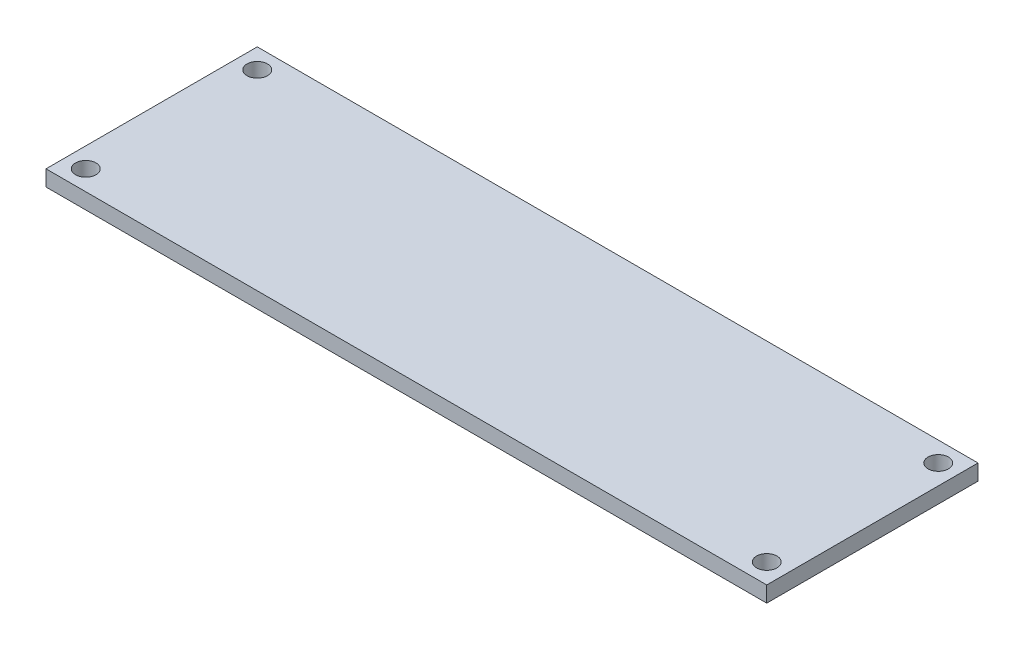
ISO-10303-21;
HEADER;
FILE_DESCRIPTION(('STEP AP214'),'2;1');
FILE_NAME('part.step','',(''),(''),'','','');
FILE_SCHEMA(('AUTOMOTIVE_DESIGN { 1 0 10303 214 1 1 1 1 }'));
ENDSEC;
DATA;
#1=APPLICATION_CONTEXT('core data for automotive mechanical design processes');
#2=APPLICATION_PROTOCOL_DEFINITION('international standard','automotive_design',2000,#1);
#3=PRODUCT_CONTEXT('',#1,'mechanical');
#4=PRODUCT('Part','Part','',(#3));
#5=PRODUCT_RELATED_PRODUCT_CATEGORY('part','',(#4));
#6=PRODUCT_DEFINITION_FORMATION('','',#4);
#7=PRODUCT_DEFINITION_CONTEXT('part definition',#1,'design');
#8=PRODUCT_DEFINITION('design','',#6,#7);
#9=PRODUCT_DEFINITION_SHAPE('','',#8);
#10=(LENGTH_UNIT() NAMED_UNIT(*) SI_UNIT(.MILLI.,.METRE.));
#11=(NAMED_UNIT(*) PLANE_ANGLE_UNIT() SI_UNIT($,.RADIAN.));
#12=(NAMED_UNIT(*) SI_UNIT($,.STERADIAN.) SOLID_ANGLE_UNIT());
#13=UNCERTAINTY_MEASURE_WITH_UNIT(LENGTH_MEASURE(1.E-05),#10,'distance_accuracy_value','');
#14=(GEOMETRIC_REPRESENTATION_CONTEXT(3) GLOBAL_UNCERTAINTY_ASSIGNED_CONTEXT((#13)) GLOBAL_UNIT_ASSIGNED_CONTEXT((#10,
#11,#12)) REPRESENTATION_CONTEXT('',''));
#15=CARTESIAN_POINT('',(0.,0.,0.));
#16=DIRECTION('',(0.,0.,1.));
#17=DIRECTION('',(1.,0.,0.));
#18=AXIS2_PLACEMENT_3D('',#15,#16,#17);
#19=CARTESIAN_POINT('',(28.9999999882,-0.635,-8.4999999926));
#20=DIRECTION('',(-1.,0.,0.));
#21=DIRECTION('',(0.,0.,1.));
#22=AXIS2_PLACEMENT_3D('',#19,#20,#21);
#23=PLANE('',#22);
#24=DIRECTION('',(0.,-1.,0.));
#25=VECTOR('',#24,1.);
#26=CARTESIAN_POINT('',(28.9999999882,0.,-8.4999999926));
#27=LINE('',#26,#25);
#28=CARTESIAN_POINT('',(28.9999999882,0.635,-8.4999999926));
#29=VERTEX_POINT('',#28);
#30=CARTESIAN_POINT('',(28.9999999882,-0.635,-8.4999999926));
#31=VERTEX_POINT('',#30);
#32=EDGE_CURVE('E73',#29,#31,#27,.T.);
#33=ORIENTED_EDGE('',*,*,#32,.F.);
#34=DIRECTION('',(0.,0.,-1.));
#35=VECTOR('',#34,1.);
#36=CARTESIAN_POINT('',(28.9999999882,0.635,0.));
#37=LINE('',#36,#35);
#38=CARTESIAN_POINT('',(28.9999999882,0.635,8.4999999926));
#39=VERTEX_POINT('',#38);
#40=EDGE_CURVE('E69',#39,#29,#37,.T.);
#41=ORIENTED_EDGE('',*,*,#40,.F.);
#42=DIRECTION('',(0.,-1.,0.));
#43=VECTOR('',#42,1.);
#44=CARTESIAN_POINT('',(28.9999999882,0.,8.4999999926));
#45=LINE('',#44,#43);
#46=CARTESIAN_POINT('',(28.9999999882,-0.635,8.4999999926));
#47=VERTEX_POINT('',#46);
#48=EDGE_CURVE('E58',#39,#47,#45,.T.);
#49=ORIENTED_EDGE('',*,*,#48,.T.);
#50=DIRECTION('',(0.,0.,-1.));
#51=VECTOR('',#50,1.);
#52=CARTESIAN_POINT('',(28.9999999882,-0.635,0.));
#53=LINE('',#52,#51);
#54=EDGE_CURVE('E97',#47,#31,#53,.T.);
#55=ORIENTED_EDGE('',*,*,#54,.T.);
#56=EDGE_LOOP('',(#33,#41,#49,#55));
#57=FACE_BOUND('',#56,.T.);
#58=ADVANCED_FACE('F16',(#57),#23,.F.);
#59=CARTESIAN_POINT('',(28.9999999882,-0.635,-8.4999999926));
#60=DIRECTION('',(0.,0.,-1.));
#61=DIRECTION('',(-1.,0.,0.));
#62=AXIS2_PLACEMENT_3D('',#59,#60,#61);
#63=PLANE('',#62);
#64=DIRECTION('',(-1.,0.,0.));
#65=VECTOR('',#64,1.);
#66=CARTESIAN_POINT('',(0.,0.635,-8.4999999926));
#67=LINE('',#66,#65);
#68=CARTESIAN_POINT('',(-28.9999999882,0.635,-8.4999999926));
#69=VERTEX_POINT('',#68);
#70=EDGE_CURVE('E75',#29,#69,#67,.T.);
#71=ORIENTED_EDGE('',*,*,#70,.F.);
#72=ORIENTED_EDGE('',*,*,#32,.T.);
#73=DIRECTION('',(-1.,0.,0.));
#74=VECTOR('',#73,1.);
#75=CARTESIAN_POINT('',(0.,-0.635,-8.4999999926));
#76=LINE('',#75,#74);
#77=CARTESIAN_POINT('',(-28.9999999882,-0.635,-8.4999999926));
#78=VERTEX_POINT('',#77);
#79=EDGE_CURVE('E107',#31,#78,#76,.T.);
#80=ORIENTED_EDGE('',*,*,#79,.T.);
#81=DIRECTION('',(0.,-1.,0.));
#82=VECTOR('',#81,1.);
#83=CARTESIAN_POINT('',(-28.9999999882,0.,-8.4999999926));
#84=LINE('',#83,#82);
#85=EDGE_CURVE('E81',#69,#78,#84,.T.);
#86=ORIENTED_EDGE('',*,*,#85,.F.);
#87=EDGE_LOOP('',(#71,#72,#80,#86));
#88=FACE_BOUND('',#87,.T.);
#89=ADVANCED_FACE('F118',(#88),#63,.T.);
#90=CARTESIAN_POINT('',(-28.9999999882,-0.635,-8.4999999926));
#91=DIRECTION('',(-1.,0.,0.));
#92=DIRECTION('',(0.,0.,1.));
#93=AXIS2_PLACEMENT_3D('',#90,#91,#92);
#94=PLANE('',#93);
#95=DIRECTION('',(0.,0.,1.));
#96=VECTOR('',#95,1.);
#97=CARTESIAN_POINT('',(-28.9999999882,0.635,0.));
#98=LINE('',#97,#96);
#99=CARTESIAN_POINT('',(-28.9999999882,0.635,8.4999999926));
#100=VERTEX_POINT('',#99);
#101=EDGE_CURVE('E71',#69,#100,#98,.T.);
#102=ORIENTED_EDGE('',*,*,#101,.F.);
#103=ORIENTED_EDGE('',*,*,#85,.T.);
#104=DIRECTION('',(0.,0.,1.));
#105=VECTOR('',#104,1.);
#106=CARTESIAN_POINT('',(-28.9999999882,-0.635,0.));
#107=LINE('',#106,#105);
#108=CARTESIAN_POINT('',(-28.9999999882,-0.635,8.4999999926));
#109=VERTEX_POINT('',#108);
#110=EDGE_CURVE('E110',#78,#109,#107,.T.);
#111=ORIENTED_EDGE('',*,*,#110,.T.);
#112=DIRECTION('',(0.,1.,0.));
#113=VECTOR('',#112,1.);
#114=CARTESIAN_POINT('',(-28.9999999882,0.,8.4999999926));
#115=LINE('',#114,#113);
#116=EDGE_CURVE('E35',#109,#100,#115,.T.);
#117=ORIENTED_EDGE('',*,*,#116,.T.);
#118=EDGE_LOOP('',(#102,#103,#111,#117));
#119=FACE_BOUND('',#118,.T.);
#120=ADVANCED_FACE('F113',(#119),#94,.T.);
#121=CARTESIAN_POINT('',(28.9999999882,-0.635,8.4999999926));
#122=DIRECTION('',(0.,0.,-1.));
#123=DIRECTION('',(-1.,0.,0.));
#124=AXIS2_PLACEMENT_3D('',#121,#122,#123);
#125=PLANE('',#124);
#126=ORIENTED_EDGE('',*,*,#48,.F.);
#127=DIRECTION('',(1.,0.,0.));
#128=VECTOR('',#127,1.);
#129=CARTESIAN_POINT('',(0.,0.635,8.4999999926));
#130=LINE('',#129,#128);
#131=EDGE_CURVE('E61',#100,#39,#130,.T.);
#132=ORIENTED_EDGE('',*,*,#131,.F.);
#133=ORIENTED_EDGE('',*,*,#116,.F.);
#134=DIRECTION('',(1.,0.,0.));
#135=VECTOR('',#134,1.);
#136=CARTESIAN_POINT('',(0.,-0.635,8.4999999926));
#137=LINE('',#136,#135);
#138=EDGE_CURVE('E62',#109,#47,#137,.T.);
#139=ORIENTED_EDGE('',*,*,#138,.T.);
#140=EDGE_LOOP('',(#126,#132,#133,#139));
#141=FACE_BOUND('',#140,.T.);
#142=ADVANCED_FACE('F60',(#141),#125,.F.);
#143=CARTESIAN_POINT('',(-27.3999999878,0.635,-6.8999999922));
#144=DIRECTION('',(0.,-1.,0.));
#145=DIRECTION('',(0.,0.,-1.));
#146=AXIS2_PLACEMENT_3D('',#143,#144,#145);
#147=CYLINDRICAL_SURFACE('',#146,0.825000001);
#148=CARTESIAN_POINT('',(-27.3999999878,-0.635,-6.8999999922));
#149=DIRECTION('',(0.,-1.,0.));
#150=DIRECTION('',(0.,0.,-1.));
#151=AXIS2_PLACEMENT_3D('',#148,#149,#150);
#152=CIRCLE('',#151,0.825000001);
#153=CARTESIAN_POINT('',(-27.3999999878,-0.635,-7.7249999932));
#154=VERTEX_POINT('',#153);
#155=EDGE_CURVE('E92',#154,#154,#152,.T.);
#156=ORIENTED_EDGE('',*,*,#155,.T.);
#157=EDGE_LOOP('',(#156));
#158=FACE_BOUND('',#157,.T.);
#159=CARTESIAN_POINT('',(-27.3999999878,0.635,-6.8999999922));
#160=DIRECTION('',(0.,-1.,0.));
#161=DIRECTION('',(0.,0.,-1.));
#162=AXIS2_PLACEMENT_3D('',#159,#160,#161);
#163=CIRCLE('',#162,0.825000001);
#164=CARTESIAN_POINT('',(-27.3999999878,0.635,-7.7249999932));
#165=VERTEX_POINT('',#164);
#166=EDGE_CURVE('E20',#165,#165,#163,.T.);
#167=ORIENTED_EDGE('',*,*,#166,.F.);
#168=EDGE_LOOP('',(#167));
#169=FACE_BOUND('',#168,.T.);
#170=ADVANCED_FACE('F145',(#158,#169),#147,.F.);
#171=CARTESIAN_POINT('',(27.3999999878,0.635,6.8999999922));
#172=DIRECTION('',(0.,-1.,0.));
#173=DIRECTION('',(0.,0.,-1.));
#174=AXIS2_PLACEMENT_3D('',#171,#172,#173);
#175=CYLINDRICAL_SURFACE('',#174,0.825000001000001);
#176=CARTESIAN_POINT('',(27.3999999878,-0.635,6.8999999922));
#177=DIRECTION('',(0.,-1.,0.));
#178=DIRECTION('',(0.,0.,-1.));
#179=AXIS2_PLACEMENT_3D('',#176,#177,#178);
#180=CIRCLE('',#179,0.825000001000001);
#181=CARTESIAN_POINT('',(27.3999999878,-0.635,6.0749999912));
#182=VERTEX_POINT('',#181);
#183=EDGE_CURVE('E89',#182,#182,#180,.T.);
#184=ORIENTED_EDGE('',*,*,#183,.T.);
#185=EDGE_LOOP('',(#184));
#186=FACE_BOUND('',#185,.T.);
#187=CARTESIAN_POINT('',(27.3999999878,0.635,6.8999999922));
#188=DIRECTION('',(0.,-1.,0.));
#189=DIRECTION('',(0.,0.,-1.));
#190=AXIS2_PLACEMENT_3D('',#187,#188,#189);
#191=CIRCLE('',#190,0.825000001000001);
#192=CARTESIAN_POINT('',(27.3999999878,0.635,6.0749999912));
#193=VERTEX_POINT('',#192);
#194=EDGE_CURVE('E98',#193,#193,#191,.T.);
#195=ORIENTED_EDGE('',*,*,#194,.F.);
#196=EDGE_LOOP('',(#195));
#197=FACE_BOUND('',#196,.T.);
#198=ADVANCED_FACE('F141',(#186,#197),#175,.F.);
#199=CARTESIAN_POINT('',(27.3999999878,0.635,-6.8999999922));
#200=DIRECTION('',(0.,-1.,0.));
#201=DIRECTION('',(0.,0.,-1.));
#202=AXIS2_PLACEMENT_3D('',#199,#200,#201);
#203=CYLINDRICAL_SURFACE('',#202,0.825000001);
#204=CARTESIAN_POINT('',(27.3999999878,-0.635,-6.8999999922));
#205=DIRECTION('',(0.,-1.,0.));
#206=DIRECTION('',(0.,0.,-1.));
#207=AXIS2_PLACEMENT_3D('',#204,#205,#206);
#208=CIRCLE('',#207,0.825000001);
#209=CARTESIAN_POINT('',(27.3999999878,-0.635,-7.7249999932));
#210=VERTEX_POINT('',#209);
#211=EDGE_CURVE('E86',#210,#210,#208,.T.);
#212=ORIENTED_EDGE('',*,*,#211,.T.);
#213=EDGE_LOOP('',(#212));
#214=FACE_BOUND('',#213,.T.);
#215=CARTESIAN_POINT('',(27.3999999878,0.635,-6.8999999922));
#216=DIRECTION('',(0.,-1.,0.));
#217=DIRECTION('',(0.,0.,-1.));
#218=AXIS2_PLACEMENT_3D('',#215,#216,#217);
#219=CIRCLE('',#218,0.825000001);
#220=CARTESIAN_POINT('',(27.3999999878,0.635,-7.7249999932));
#221=VERTEX_POINT('',#220);
#222=EDGE_CURVE('E95',#221,#221,#219,.T.);
#223=ORIENTED_EDGE('',*,*,#222,.F.);
#224=EDGE_LOOP('',(#223));
#225=FACE_BOUND('',#224,.T.);
#226=ADVANCED_FACE('F138',(#214,#225),#203,.F.);
#227=CARTESIAN_POINT('',(-28.9999999882,0.635,-8.4999999926));
#228=DIRECTION('',(0.,1.,0.));
#229=DIRECTION('',(0.,0.,1.));
#230=AXIS2_PLACEMENT_3D('',#227,#228,#229);
#231=PLANE('',#230);
#232=ORIENTED_EDGE('',*,*,#222,.T.);
#233=EDGE_LOOP('',(#232));
#234=FACE_BOUND('',#233,.T.);
#235=ORIENTED_EDGE('',*,*,#194,.T.);
#236=EDGE_LOOP('',(#235));
#237=FACE_BOUND('',#236,.T.);
#238=ORIENTED_EDGE('',*,*,#166,.T.);
#239=EDGE_LOOP('',(#238));
#240=FACE_BOUND('',#239,.T.);
#241=CARTESIAN_POINT('',(-27.3999999878,0.635,6.8999999922));
#242=DIRECTION('',(0.,-1.,0.));
#243=DIRECTION('',(0.,0.,-1.));
#244=AXIS2_PLACEMENT_3D('',#241,#242,#243);
#245=CIRCLE('',#244,0.825000001000001);
#246=CARTESIAN_POINT('',(-27.3999999878,0.635,6.0749999912));
#247=VERTEX_POINT('',#246);
#248=EDGE_CURVE('E26',#247,#247,#245,.F.);
#249=ORIENTED_EDGE('',*,*,#248,.F.);
#250=EDGE_LOOP('',(#249));
#251=FACE_BOUND('',#250,.T.);
#252=ORIENTED_EDGE('',*,*,#70,.T.);
#253=ORIENTED_EDGE('',*,*,#101,.T.);
#254=ORIENTED_EDGE('',*,*,#131,.T.);
#255=ORIENTED_EDGE('',*,*,#40,.T.);
#256=EDGE_LOOP('',(#252,#253,#254,#255));
#257=FACE_BOUND('',#256,.T.);
#258=ADVANCED_FACE('F68',(#234,#237,#240,#251,#257),#231,.T.);
#259=CARTESIAN_POINT('',(-28.9999999882,-0.635,-8.4999999926));
#260=DIRECTION('',(0.,1.,0.));
#261=DIRECTION('',(0.,0.,1.));
#262=AXIS2_PLACEMENT_3D('',#259,#260,#261);
#263=PLANE('',#262);
#264=ORIENTED_EDGE('',*,*,#211,.F.);
#265=EDGE_LOOP('',(#264));
#266=FACE_BOUND('',#265,.T.);
#267=ORIENTED_EDGE('',*,*,#183,.F.);
#268=EDGE_LOOP('',(#267));
#269=FACE_BOUND('',#268,.T.);
#270=ORIENTED_EDGE('',*,*,#155,.F.);
#271=EDGE_LOOP('',(#270));
#272=FACE_BOUND('',#271,.T.);
#273=CARTESIAN_POINT('',(-27.3999999878,-0.635,6.8999999922));
#274=DIRECTION('',(0.,-1.,0.));
#275=DIRECTION('',(0.,0.,-1.));
#276=AXIS2_PLACEMENT_3D('',#273,#274,#275);
#277=CIRCLE('',#276,0.825000001000001);
#278=CARTESIAN_POINT('',(-27.3999999878,-0.635,6.0749999912));
#279=VERTEX_POINT('',#278);
#280=EDGE_CURVE('E11',#279,#279,#277,.T.);
#281=ORIENTED_EDGE('',*,*,#280,.F.);
#282=EDGE_LOOP('',(#281));
#283=FACE_BOUND('',#282,.T.);
#284=ORIENTED_EDGE('',*,*,#110,.F.);
#285=ORIENTED_EDGE('',*,*,#79,.F.);
#286=ORIENTED_EDGE('',*,*,#54,.F.);
#287=ORIENTED_EDGE('',*,*,#138,.F.);
#288=EDGE_LOOP('',(#284,#285,#286,#287));
#289=FACE_BOUND('',#288,.T.);
#290=ADVANCED_FACE('F18',(#266,#269,#272,#283,#289),#263,.F.);
#291=CARTESIAN_POINT('',(-27.3999999878,0.635,6.8999999922));
#292=DIRECTION('',(0.,-1.,0.));
#293=DIRECTION('',(0.,0.,-1.));
#294=AXIS2_PLACEMENT_3D('',#291,#292,#293);
#295=CYLINDRICAL_SURFACE('',#294,0.825000001000001);
#296=ORIENTED_EDGE('',*,*,#248,.T.);
#297=EDGE_LOOP('',(#296));
#298=FACE_BOUND('',#297,.T.);
#299=ORIENTED_EDGE('',*,*,#280,.T.);
#300=EDGE_LOOP('',(#299));
#301=FACE_BOUND('',#300,.T.);
#302=ADVANCED_FACE('F128',(#298,#301),#295,.F.);
#303=CLOSED_SHELL('',(#58,#89,#120,#142,#170,#198,#226,#258,#290,#302));
#304=MANIFOLD_SOLID_BREP('B1',#303);
#305=ADVANCED_BREP_SHAPE_REPRESENTATION('',(#18,#304),#14);
#306=SHAPE_DEFINITION_REPRESENTATION(#9,#305);
ENDSEC;
END-ISO-10303-21;
